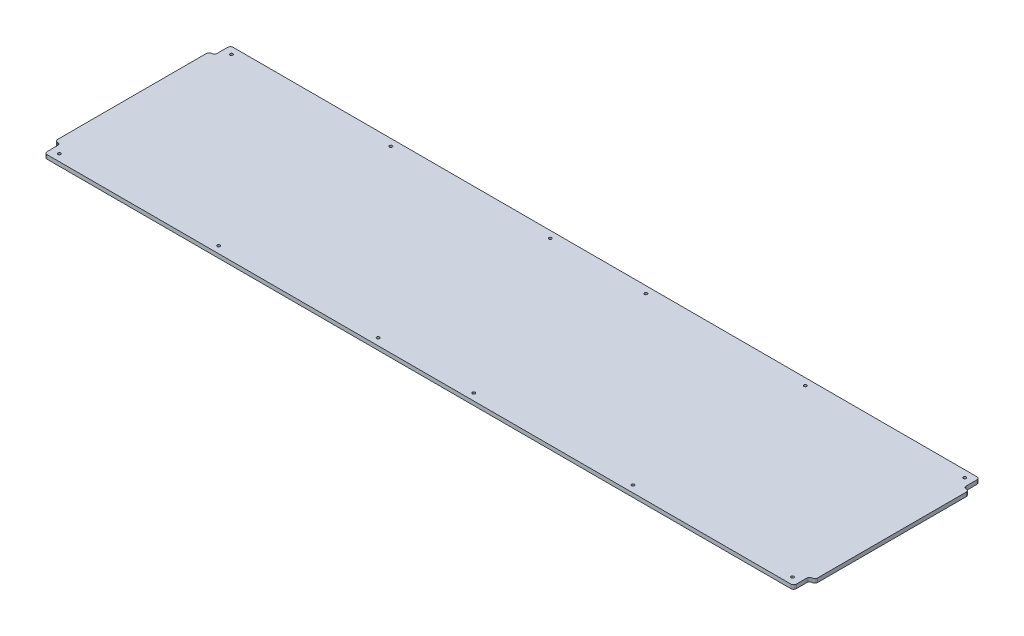
ISO-10303-21;
HEADER;
FILE_DESCRIPTION(('STEP AP214'),'2;1');
FILE_NAME('part.step','',(''),(''),'','','');
FILE_SCHEMA(('AUTOMOTIVE_DESIGN { 1 0 10303 214 1 1 1 1 }'));
ENDSEC;
DATA;
#1=APPLICATION_CONTEXT('core data for automotive mechanical design processes');
#2=APPLICATION_PROTOCOL_DEFINITION('international standard','automotive_design',2000,#1);
#3=PRODUCT_CONTEXT('',#1,'mechanical');
#4=PRODUCT('Part','Part','',(#3));
#5=PRODUCT_RELATED_PRODUCT_CATEGORY('part','',(#4));
#6=PRODUCT_DEFINITION_FORMATION('','',#4);
#7=PRODUCT_DEFINITION_CONTEXT('part definition',#1,'design');
#8=PRODUCT_DEFINITION('design','',#6,#7);
#9=PRODUCT_DEFINITION_SHAPE('','',#8);
#10=(LENGTH_UNIT() NAMED_UNIT(*) SI_UNIT(.MILLI.,.METRE.));
#11=(NAMED_UNIT(*) PLANE_ANGLE_UNIT() SI_UNIT($,.RADIAN.));
#12=(NAMED_UNIT(*) SI_UNIT($,.STERADIAN.) SOLID_ANGLE_UNIT());
#13=UNCERTAINTY_MEASURE_WITH_UNIT(LENGTH_MEASURE(1.E-05),#10,'distance_accuracy_value','');
#14=(GEOMETRIC_REPRESENTATION_CONTEXT(3) GLOBAL_UNCERTAINTY_ASSIGNED_CONTEXT((#13)) GLOBAL_UNIT_ASSIGNED_CONTEXT((#10,
#11,#12)) REPRESENTATION_CONTEXT('',''));
#15=CARTESIAN_POINT('',(0.,0.,0.));
#16=DIRECTION('',(0.,0.,1.));
#17=DIRECTION('',(1.,0.,0.));
#18=AXIS2_PLACEMENT_3D('',#15,#16,#17);
#19=CARTESIAN_POINT('',(895.35,9.525,222.25));
#20=DIRECTION('',(-1.,0.,0.));
#21=DIRECTION('',(0.,0.,1.));
#22=AXIS2_PLACEMENT_3D('',#19,#20,#21);
#23=PLANE('',#22);
#24=DIRECTION('',(0.,0.,-1.));
#25=VECTOR('',#24,1.);
#26=CARTESIAN_POINT('',(895.35,9.525,222.25));
#27=LINE('',#26,#25);
#28=CARTESIAN_POINT('',(895.35,9.525,215.9));
#29=VERTEX_POINT('',#28);
#30=CARTESIAN_POINT('',(895.35,9.525,190.5));
#31=VERTEX_POINT('',#30);
#32=EDGE_CURVE('E198',#29,#31,#27,.T.);
#33=ORIENTED_EDGE('',*,*,#32,.F.);
#34=DIRECTION('',(0.,-1.,0.));
#35=VECTOR('',#34,1.);
#36=CARTESIAN_POINT('',(895.35,9.525,215.9));
#37=LINE('',#36,#35);
#38=CARTESIAN_POINT('',(895.35,0.,215.9));
#39=VERTEX_POINT('',#38);
#40=EDGE_CURVE('E181',#29,#39,#37,.T.);
#41=ORIENTED_EDGE('',*,*,#40,.T.);
#42=DIRECTION('',(0.,0.,-1.));
#43=VECTOR('',#42,1.);
#44=CARTESIAN_POINT('',(895.35,0.,222.25));
#45=LINE('',#44,#43);
#46=CARTESIAN_POINT('',(895.35,0.,190.5));
#47=VERTEX_POINT('',#46);
#48=EDGE_CURVE('E195',#39,#47,#45,.T.);
#49=ORIENTED_EDGE('',*,*,#48,.T.);
#50=DIRECTION('',(0.,-1.,0.));
#51=VECTOR('',#50,1.);
#52=CARTESIAN_POINT('',(895.35,9.525,190.5));
#53=LINE('',#52,#51);
#54=EDGE_CURVE('E201',#47,#31,#53,.F.);
#55=ORIENTED_EDGE('',*,*,#54,.T.);
#56=EDGE_LOOP('',(#33,#41,#49,#55));
#57=FACE_BOUND('',#56,.T.);
#58=ADVANCED_FACE('F38',(#57),#23,.F.);
#59=CARTESIAN_POINT('',(908.05,9.525,-184.15));
#60=DIRECTION('',(-1.,0.,0.));
#61=DIRECTION('',(0.,0.,1.));
#62=AXIS2_PLACEMENT_3D('',#59,#60,#61);
#63=PLANE('',#62);
#64=DIRECTION('',(0.,0.,-1.));
#65=VECTOR('',#64,1.);
#66=CARTESIAN_POINT('',(908.05,9.525,-184.15));
#67=LINE('',#66,#65);
#68=CARTESIAN_POINT('',(908.05,9.525,177.8));
#69=VERTEX_POINT('',#68);
#70=CARTESIAN_POINT('',(908.05,9.525,-177.8));
#71=VERTEX_POINT('',#70);
#72=EDGE_CURVE('E816',#69,#71,#67,.T.);
#73=ORIENTED_EDGE('',*,*,#72,.F.);
#74=DIRECTION('',(0.,-1.,0.));
#75=VECTOR('',#74,1.);
#76=CARTESIAN_POINT('',(908.05,9.525,177.8));
#77=LINE('',#76,#75);
#78=CARTESIAN_POINT('',(908.05,0.,177.8));
#79=VERTEX_POINT('',#78);
#80=EDGE_CURVE('E298',#69,#79,#77,.T.);
#81=ORIENTED_EDGE('',*,*,#80,.T.);
#82=DIRECTION('',(0.,0.,-1.));
#83=VECTOR('',#82,1.);
#84=CARTESIAN_POINT('',(908.05,0.,-184.15));
#85=LINE('',#84,#83);
#86=CARTESIAN_POINT('',(908.05,0.,-177.8));
#87=VERTEX_POINT('',#86);
#88=EDGE_CURVE('E207',#79,#87,#85,.T.);
#89=ORIENTED_EDGE('',*,*,#88,.T.);
#90=DIRECTION('',(0.,-1.,0.));
#91=VECTOR('',#90,1.);
#92=CARTESIAN_POINT('',(908.05,9.525,-177.8));
#93=LINE('',#92,#91);
#94=EDGE_CURVE('E294',#87,#71,#93,.F.);
#95=ORIENTED_EDGE('',*,*,#94,.T.);
#96=EDGE_LOOP('',(#73,#81,#89,#95));
#97=FACE_BOUND('',#96,.T.);
#98=ADVANCED_FACE('F436',(#97),#63,.F.);
#99=CARTESIAN_POINT('',(895.35,9.525,-222.25));
#100=DIRECTION('',(-1.,0.,0.));
#101=DIRECTION('',(0.,0.,1.));
#102=AXIS2_PLACEMENT_3D('',#99,#100,#101);
#103=PLANE('',#102);
#104=DIRECTION('',(0.,0.,-1.));
#105=VECTOR('',#104,1.);
#106=CARTESIAN_POINT('',(895.35,9.525,-222.25));
#107=LINE('',#106,#105);
#108=CARTESIAN_POINT('',(895.35,9.525,-190.5));
#109=VERTEX_POINT('',#108);
#110=CARTESIAN_POINT('',(895.35,9.525,-215.9));
#111=VERTEX_POINT('',#110);
#112=EDGE_CURVE('E412',#109,#111,#107,.T.);
#113=ORIENTED_EDGE('',*,*,#112,.F.);
#114=DIRECTION('',(0.,-1.,0.));
#115=VECTOR('',#114,1.);
#116=CARTESIAN_POINT('',(895.35,0.,-190.5));
#117=LINE('',#116,#115);
#118=CARTESIAN_POINT('',(895.35,0.,-190.5));
#119=VERTEX_POINT('',#118);
#120=EDGE_CURVE('E304',#109,#119,#117,.T.);
#121=ORIENTED_EDGE('',*,*,#120,.T.);
#122=DIRECTION('',(0.,0.,-1.));
#123=VECTOR('',#122,1.);
#124=CARTESIAN_POINT('',(895.35,0.,-222.25));
#125=LINE('',#124,#123);
#126=CARTESIAN_POINT('',(895.35,0.,-215.9));
#127=VERTEX_POINT('',#126);
#128=EDGE_CURVE('E214',#119,#127,#125,.T.);
#129=ORIENTED_EDGE('',*,*,#128,.T.);
#130=DIRECTION('',(0.,-1.,0.));
#131=VECTOR('',#130,1.);
#132=CARTESIAN_POINT('',(895.35,9.525,-215.9));
#133=LINE('',#132,#131);
#134=EDGE_CURVE('E301',#127,#111,#133,.F.);
#135=ORIENTED_EDGE('',*,*,#134,.T.);
#136=EDGE_LOOP('',(#113,#121,#129,#135));
#137=FACE_BOUND('',#136,.T.);
#138=ADVANCED_FACE('F441',(#137),#103,.F.);
#139=CARTESIAN_POINT('',(-895.35,9.525,-222.25));
#140=DIRECTION('',(0.,0.,1.));
#141=DIRECTION('',(1.,0.,0.));
#142=AXIS2_PLACEMENT_3D('',#139,#140,#141);
#143=PLANE('',#142);
#144=DIRECTION('',(-1.,0.,0.));
#145=VECTOR('',#144,1.);
#146=CARTESIAN_POINT('',(-895.35,9.525,-222.25));
#147=LINE('',#146,#145);
#148=CARTESIAN_POINT('',(889.,9.525,-222.25));
#149=VERTEX_POINT('',#148);
#150=CARTESIAN_POINT('',(-889.,9.525,-222.25));
#151=VERTEX_POINT('',#150);
#152=EDGE_CURVE('E405',#149,#151,#147,.T.);
#153=ORIENTED_EDGE('',*,*,#152,.F.);
#154=DIRECTION('',(0.,-1.,0.));
#155=VECTOR('',#154,1.);
#156=CARTESIAN_POINT('',(889.,9.525,-222.25));
#157=LINE('',#156,#155);
#158=CARTESIAN_POINT('',(889.,0.,-222.25));
#159=VERTEX_POINT('',#158);
#160=EDGE_CURVE('E310',#149,#159,#157,.T.);
#161=ORIENTED_EDGE('',*,*,#160,.T.);
#162=DIRECTION('',(-1.,0.,0.));
#163=VECTOR('',#162,1.);
#164=CARTESIAN_POINT('',(-895.35,0.,-222.25));
#165=LINE('',#164,#163);
#166=CARTESIAN_POINT('',(-889.,0.,-222.25));
#167=VERTEX_POINT('',#166);
#168=EDGE_CURVE('E226',#159,#167,#165,.T.);
#169=ORIENTED_EDGE('',*,*,#168,.T.);
#170=DIRECTION('',(0.,-1.,0.));
#171=VECTOR('',#170,1.);
#172=CARTESIAN_POINT('',(-889.,9.525,-222.25));
#173=LINE('',#172,#171);
#174=EDGE_CURVE('E307',#167,#151,#173,.F.);
#175=ORIENTED_EDGE('',*,*,#174,.T.);
#176=EDGE_LOOP('',(#153,#161,#169,#175));
#177=FACE_BOUND('',#176,.T.);
#178=ADVANCED_FACE('F656',(#177),#143,.F.);
#179=CARTESIAN_POINT('',(-895.35,9.525,-222.25));
#180=DIRECTION('',(1.,0.,0.));
#181=DIRECTION('',(0.,0.,-1.));
#182=AXIS2_PLACEMENT_3D('',#179,#180,#181);
#183=PLANE('',#182);
#184=DIRECTION('',(0.,0.,1.));
#185=VECTOR('',#184,1.);
#186=CARTESIAN_POINT('',(-895.35,0.,-222.25));
#187=LINE('',#186,#185);
#188=CARTESIAN_POINT('',(-895.35,0.,-215.9));
#189=VERTEX_POINT('',#188);
#190=CARTESIAN_POINT('',(-895.35,0.,-190.5));
#191=VERTEX_POINT('',#190);
#192=EDGE_CURVE('E230',#189,#191,#187,.T.);
#193=ORIENTED_EDGE('',*,*,#192,.T.);
#194=DIRECTION('',(0.,-1.,0.));
#195=VECTOR('',#194,1.);
#196=CARTESIAN_POINT('',(-895.35,9.525,-190.5));
#197=LINE('',#196,#195);
#198=CARTESIAN_POINT('',(-895.35,9.525,-190.5));
#199=VERTEX_POINT('',#198);
#200=EDGE_CURVE('E325',#191,#199,#197,.F.);
#201=ORIENTED_EDGE('',*,*,#200,.T.);
#202=DIRECTION('',(0.,0.,1.));
#203=VECTOR('',#202,1.);
#204=CARTESIAN_POINT('',(-895.35,9.525,-222.25));
#205=LINE('',#204,#203);
#206=CARTESIAN_POINT('',(-895.35,9.525,-215.9));
#207=VERTEX_POINT('',#206);
#208=EDGE_CURVE('E398',#207,#199,#205,.T.);
#209=ORIENTED_EDGE('',*,*,#208,.F.);
#210=DIRECTION('',(0.,-1.,0.));
#211=VECTOR('',#210,1.);
#212=CARTESIAN_POINT('',(-895.35,9.525,-215.9));
#213=LINE('',#212,#211);
#214=EDGE_CURVE('E321',#207,#189,#213,.T.);
#215=ORIENTED_EDGE('',*,*,#214,.T.);
#216=EDGE_LOOP('',(#193,#201,#209,#215));
#217=FACE_BOUND('',#216,.T.);
#218=ADVANCED_FACE('F397',(#217),#183,.F.);
#219=CARTESIAN_POINT('',(-908.05,9.525,-184.15));
#220=DIRECTION('',(1.,0.,0.));
#221=DIRECTION('',(0.,0.,-1.));
#222=AXIS2_PLACEMENT_3D('',#219,#220,#221);
#223=PLANE('',#222);
#224=DIRECTION('',(0.,0.,1.));
#225=VECTOR('',#224,1.);
#226=CARTESIAN_POINT('',(-908.05,9.525,-184.15));
#227=LINE('',#226,#225);
#228=CARTESIAN_POINT('',(-908.05,9.525,-177.8));
#229=VERTEX_POINT('',#228);
#230=CARTESIAN_POINT('',(-908.05,9.525,177.8));
#231=VERTEX_POINT('',#230);
#232=EDGE_CURVE('E386',#229,#231,#227,.T.);
#233=ORIENTED_EDGE('',*,*,#232,.F.);
#234=DIRECTION('',(0.,-1.,0.));
#235=VECTOR('',#234,1.);
#236=CARTESIAN_POINT('',(-908.05,9.525,-177.8));
#237=LINE('',#236,#235);
#238=CARTESIAN_POINT('',(-908.05,0.,-177.8));
#239=VERTEX_POINT('',#238);
#240=EDGE_CURVE('E317',#229,#239,#237,.T.);
#241=ORIENTED_EDGE('',*,*,#240,.T.);
#242=DIRECTION('',(0.,0.,1.));
#243=VECTOR('',#242,1.);
#244=CARTESIAN_POINT('',(-908.05,0.,-184.15));
#245=LINE('',#244,#243);
#246=CARTESIAN_POINT('',(-908.05,0.,177.8));
#247=VERTEX_POINT('',#246);
#248=EDGE_CURVE('E234',#239,#247,#245,.T.);
#249=ORIENTED_EDGE('',*,*,#248,.T.);
#250=DIRECTION('',(0.,-1.,0.));
#251=VECTOR('',#250,1.);
#252=CARTESIAN_POINT('',(-908.05,9.525,177.8));
#253=LINE('',#252,#251);
#254=EDGE_CURVE('E314',#247,#231,#253,.F.);
#255=ORIENTED_EDGE('',*,*,#254,.T.);
#256=EDGE_LOOP('',(#233,#241,#249,#255));
#257=FACE_BOUND('',#256,.T.);
#258=ADVANCED_FACE('F383',(#257),#223,.F.);
#259=CARTESIAN_POINT('',(-895.35,9.525,184.15));
#260=DIRECTION('',(1.,0.,0.));
#261=DIRECTION('',(0.,0.,-1.));
#262=AXIS2_PLACEMENT_3D('',#259,#260,#261);
#263=PLANE('',#262);
#264=DIRECTION('',(0.,0.,1.));
#265=VECTOR('',#264,1.);
#266=CARTESIAN_POINT('',(-895.35,0.,184.15));
#267=LINE('',#266,#265);
#268=CARTESIAN_POINT('',(-895.35,0.,190.5));
#269=VERTEX_POINT('',#268);
#270=CARTESIAN_POINT('',(-895.35,0.,215.9));
#271=VERTEX_POINT('',#270);
#272=EDGE_CURVE('E238',#269,#271,#267,.T.);
#273=ORIENTED_EDGE('',*,*,#272,.T.);
#274=DIRECTION('',(0.,-1.,0.));
#275=VECTOR('',#274,1.);
#276=CARTESIAN_POINT('',(-895.35,9.525,215.9));
#277=LINE('',#276,#275);
#278=CARTESIAN_POINT('',(-895.35,9.525,215.9));
#279=VERTEX_POINT('',#278);
#280=EDGE_CURVE('E56',#271,#279,#277,.F.);
#281=ORIENTED_EDGE('',*,*,#280,.T.);
#282=DIRECTION('',(0.,0.,1.));
#283=VECTOR('',#282,1.);
#284=CARTESIAN_POINT('',(-895.35,9.525,184.15));
#285=LINE('',#284,#283);
#286=CARTESIAN_POINT('',(-895.35,9.525,190.5));
#287=VERTEX_POINT('',#286);
#288=EDGE_CURVE('E410',#287,#279,#285,.T.);
#289=ORIENTED_EDGE('',*,*,#288,.F.);
#290=DIRECTION('',(0.,-1.,0.));
#291=VECTOR('',#290,1.);
#292=CARTESIAN_POINT('',(-895.35,0.,190.5));
#293=LINE('',#292,#291);
#294=EDGE_CURVE('E328',#287,#269,#293,.T.);
#295=ORIENTED_EDGE('',*,*,#294,.T.);
#296=EDGE_LOOP('',(#273,#281,#289,#295));
#297=FACE_BOUND('',#296,.T.);
#298=ADVANCED_FACE('F426',(#297),#263,.F.);
#299=CARTESIAN_POINT('',(-895.35,9.525,222.25));
#300=DIRECTION('',(0.,0.,-1.));
#301=DIRECTION('',(-1.,0.,0.));
#302=AXIS2_PLACEMENT_3D('',#299,#300,#301);
#303=PLANE('',#302);
#304=DIRECTION('',(1.,0.,0.));
#305=VECTOR('',#304,1.);
#306=CARTESIAN_POINT('',(-895.35,0.,222.25));
#307=LINE('',#306,#305);
#308=CARTESIAN_POINT('',(-889.,0.,222.25));
#309=VERTEX_POINT('',#308);
#310=CARTESIAN_POINT('',(889.,0.,222.25));
#311=VERTEX_POINT('',#310);
#312=EDGE_CURVE('E241',#309,#311,#307,.T.);
#313=ORIENTED_EDGE('',*,*,#312,.T.);
#314=DIRECTION('',(0.,-1.,0.));
#315=VECTOR('',#314,1.);
#316=CARTESIAN_POINT('',(889.,9.525,222.25));
#317=LINE('',#316,#315);
#318=CARTESIAN_POINT('',(889.,9.525,222.25));
#319=VERTEX_POINT('',#318);
#320=EDGE_CURVE('E182',#311,#319,#317,.F.);
#321=ORIENTED_EDGE('',*,*,#320,.T.);
#322=DIRECTION('',(1.,0.,0.));
#323=VECTOR('',#322,1.);
#324=CARTESIAN_POINT('',(-895.35,9.525,222.25));
#325=LINE('',#324,#323);
#326=CARTESIAN_POINT('',(-889.,9.525,222.25));
#327=VERTEX_POINT('',#326);
#328=EDGE_CURVE('E220',#327,#319,#325,.T.);
#329=ORIENTED_EDGE('',*,*,#328,.F.);
#330=DIRECTION('',(0.,-1.,0.));
#331=VECTOR('',#330,1.);
#332=CARTESIAN_POINT('',(-889.,9.525,222.25));
#333=LINE('',#332,#331);
#334=EDGE_CURVE('E188',#327,#309,#333,.T.);
#335=ORIENTED_EDGE('',*,*,#334,.T.);
#336=EDGE_LOOP('',(#313,#321,#329,#335));
#337=FACE_BOUND('',#336,.T.);
#338=ADVANCED_FACE('F423',(#337),#303,.F.);
#339=CARTESIAN_POINT('',(0.,9.525,0.));
#340=DIRECTION('',(0.,1.,0.));
#341=DIRECTION('',(0.,0.,1.));
#342=AXIS2_PLACEMENT_3D('',#339,#340,#341);
#343=PLANE('',#342);
#344=CARTESIAN_POINT('',(-876.3,9.525,205.74));
#345=DIRECTION('',(0.,1.,0.));
#346=DIRECTION('',(0.,0.,1.));
#347=AXIS2_PLACEMENT_3D('',#344,#345,#346);
#348=CIRCLE('',#347,3.373501);
#349=CARTESIAN_POINT('',(-876.3,9.525,209.113501));
#350=VERTEX_POINT('',#349);
#351=EDGE_CURVE('E357',#350,#350,#348,.T.);
#352=ORIENTED_EDGE('',*,*,#351,.F.);
#353=EDGE_LOOP('',(#352));
#354=FACE_BOUND('',#353,.T.);
#355=CARTESIAN_POINT('',(-495.3,9.525,205.74));
#356=DIRECTION('',(0.,1.,0.));
#357=DIRECTION('',(0.,0.,1.));
#358=AXIS2_PLACEMENT_3D('',#355,#356,#357);
#359=CIRCLE('',#358,3.373501);
#360=CARTESIAN_POINT('',(-495.3,9.525,209.113501));
#361=VERTEX_POINT('',#360);
#362=EDGE_CURVE('E917',#361,#361,#359,.T.);
#363=ORIENTED_EDGE('',*,*,#362,.F.);
#364=EDGE_LOOP('',(#363));
#365=FACE_BOUND('',#364,.T.);
#366=CARTESIAN_POINT('',(-876.3,9.525,-205.74));
#367=DIRECTION('',(0.,1.,0.));
#368=DIRECTION('',(0.,0.,1.));
#369=AXIS2_PLACEMENT_3D('',#366,#367,#368);
#370=CIRCLE('',#369,3.373501);
#371=CARTESIAN_POINT('',(-876.3,9.525,-202.366499));
#372=VERTEX_POINT('',#371);
#373=EDGE_CURVE('E909',#372,#372,#370,.T.);
#374=ORIENTED_EDGE('',*,*,#373,.F.);
#375=EDGE_LOOP('',(#374));
#376=FACE_BOUND('',#375,.T.);
#377=CARTESIAN_POINT('',(-495.3,9.525,-205.74));
#378=DIRECTION('',(0.,1.,0.));
#379=DIRECTION('',(0.,0.,1.));
#380=AXIS2_PLACEMENT_3D('',#377,#378,#379);
#381=CIRCLE('',#380,3.373501);
#382=CARTESIAN_POINT('',(-495.3,9.525,-202.366499));
#383=VERTEX_POINT('',#382);
#384=EDGE_CURVE('E901',#383,#383,#381,.T.);
#385=ORIENTED_EDGE('',*,*,#384,.F.);
#386=EDGE_LOOP('',(#385));
#387=FACE_BOUND('',#386,.T.);
#388=CARTESIAN_POINT('',(-114.3,9.525,-205.74));
#389=DIRECTION('',(0.,1.,0.));
#390=DIRECTION('',(0.,0.,1.));
#391=AXIS2_PLACEMENT_3D('',#388,#389,#390);
#392=CIRCLE('',#391,3.373501);
#393=CARTESIAN_POINT('',(-114.3,9.525,-202.366499));
#394=VERTEX_POINT('',#393);
#395=EDGE_CURVE('E893',#394,#394,#392,.T.);
#396=ORIENTED_EDGE('',*,*,#395,.F.);
#397=EDGE_LOOP('',(#396));
#398=FACE_BOUND('',#397,.T.);
#399=CARTESIAN_POINT('',(-114.3,9.525,205.74));
#400=DIRECTION('',(0.,1.,0.));
#401=DIRECTION('',(0.,0.,1.));
#402=AXIS2_PLACEMENT_3D('',#399,#400,#401);
#403=CIRCLE('',#402,3.373501);
#404=CARTESIAN_POINT('',(-114.3,9.525,209.113501));
#405=VERTEX_POINT('',#404);
#406=EDGE_CURVE('E885',#405,#405,#403,.T.);
#407=ORIENTED_EDGE('',*,*,#406,.F.);
#408=EDGE_LOOP('',(#407));
#409=FACE_BOUND('',#408,.T.);
#410=CARTESIAN_POINT('',(114.299999999999,9.525,205.74));
#411=DIRECTION('',(0.,1.,0.));
#412=DIRECTION('',(0.,0.,1.));
#413=AXIS2_PLACEMENT_3D('',#410,#411,#412);
#414=CIRCLE('',#413,3.373501);
#415=CARTESIAN_POINT('',(114.299999999999,9.525,209.113501));
#416=VERTEX_POINT('',#415);
#417=EDGE_CURVE('E877',#416,#416,#414,.T.);
#418=ORIENTED_EDGE('',*,*,#417,.F.);
#419=EDGE_LOOP('',(#418));
#420=FACE_BOUND('',#419,.T.);
#421=CARTESIAN_POINT('',(114.3,9.525,-205.74));
#422=DIRECTION('',(0.,1.,0.));
#423=DIRECTION('',(0.,0.,1.));
#424=AXIS2_PLACEMENT_3D('',#421,#422,#423);
#425=CIRCLE('',#424,3.373501);
#426=CARTESIAN_POINT('',(114.3,9.525,-202.366499));
#427=VERTEX_POINT('',#426);
#428=EDGE_CURVE('E869',#427,#427,#425,.T.);
#429=ORIENTED_EDGE('',*,*,#428,.F.);
#430=EDGE_LOOP('',(#429));
#431=FACE_BOUND('',#430,.T.);
#432=CARTESIAN_POINT('',(495.3,9.525,-205.739999999999));
#433=DIRECTION('',(0.,1.,0.));
#434=DIRECTION('',(0.,0.,1.));
#435=AXIS2_PLACEMENT_3D('',#432,#433,#434);
#436=CIRCLE('',#435,3.373501);
#437=CARTESIAN_POINT('',(495.3,9.525,-202.366498999999));
#438=VERTEX_POINT('',#437);
#439=EDGE_CURVE('E861',#438,#438,#436,.T.);
#440=ORIENTED_EDGE('',*,*,#439,.F.);
#441=EDGE_LOOP('',(#440));
#442=FACE_BOUND('',#441,.T.);
#443=CARTESIAN_POINT('',(876.3,9.525,-205.739999999999));
#444=DIRECTION('',(0.,1.,0.));
#445=DIRECTION('',(0.,0.,1.));
#446=AXIS2_PLACEMENT_3D('',#443,#444,#445);
#447=CIRCLE('',#446,3.373501);
#448=CARTESIAN_POINT('',(876.3,9.525,-202.366498999999));
#449=VERTEX_POINT('',#448);
#450=EDGE_CURVE('E853',#449,#449,#447,.T.);
#451=ORIENTED_EDGE('',*,*,#450,.F.);
#452=EDGE_LOOP('',(#451));
#453=FACE_BOUND('',#452,.T.);
#454=CARTESIAN_POINT('',(495.299999999999,9.525,205.74));
#455=DIRECTION('',(0.,1.,0.));
#456=DIRECTION('',(0.,0.,1.));
#457=AXIS2_PLACEMENT_3D('',#454,#455,#456);
#458=CIRCLE('',#457,3.373501);
#459=CARTESIAN_POINT('',(495.299999999999,9.525,209.113501));
#460=VERTEX_POINT('',#459);
#461=EDGE_CURVE('E845',#460,#460,#458,.T.);
#462=ORIENTED_EDGE('',*,*,#461,.F.);
#463=EDGE_LOOP('',(#462));
#464=FACE_BOUND('',#463,.T.);
#465=CARTESIAN_POINT('',(876.299999999999,9.525,205.740000000001));
#466=DIRECTION('',(0.,1.,0.));
#467=DIRECTION('',(0.,0.,1.));
#468=AXIS2_PLACEMENT_3D('',#465,#466,#467);
#469=CIRCLE('',#468,3.373501);
#470=CARTESIAN_POINT('',(876.299999999999,9.525,209.113501000001));
#471=VERTEX_POINT('',#470);
#472=EDGE_CURVE('E217',#471,#471,#469,.T.);
#473=ORIENTED_EDGE('',*,*,#472,.F.);
#474=EDGE_LOOP('',(#473));
#475=FACE_BOUND('',#474,.T.);
#476=ORIENTED_EDGE('',*,*,#328,.T.);
#477=CARTESIAN_POINT('',(889.,9.525,215.9));
#478=DIRECTION('',(0.,1.,0.));
#479=DIRECTION('',(0.,0.,1.));
#480=AXIS2_PLACEMENT_3D('',#477,#478,#479);
#481=CIRCLE('',#480,6.35);
#482=EDGE_CURVE('E291',#319,#29,#481,.T.);
#483=ORIENTED_EDGE('',*,*,#482,.T.);
#484=ORIENTED_EDGE('',*,*,#32,.T.);
#485=CARTESIAN_POINT('',(901.7,9.525,190.5));
#486=DIRECTION('',(0.,1.,0.));
#487=DIRECTION('',(0.,0.,1.));
#488=AXIS2_PLACEMENT_3D('',#485,#486,#487);
#489=CIRCLE('',#488,6.35);
#490=CARTESIAN_POINT('',(901.7,9.525,184.15));
#491=VERTEX_POINT('',#490);
#492=EDGE_CURVE('E336',#31,#491,#489,.F.);
#493=ORIENTED_EDGE('',*,*,#492,.T.);
#494=CARTESIAN_POINT('',(901.7,9.525,177.8));
#495=DIRECTION('',(0.,1.,0.));
#496=DIRECTION('',(0.,0.,1.));
#497=AXIS2_PLACEMENT_3D('',#494,#495,#496);
#498=CIRCLE('',#497,6.35);
#499=EDGE_CURVE('E288',#491,#69,#498,.T.);
#500=ORIENTED_EDGE('',*,*,#499,.T.);
#501=ORIENTED_EDGE('',*,*,#72,.T.);
#502=CARTESIAN_POINT('',(901.7,9.525,-177.8));
#503=DIRECTION('',(0.,1.,0.));
#504=DIRECTION('',(0.,0.,1.));
#505=AXIS2_PLACEMENT_3D('',#502,#503,#504);
#506=CIRCLE('',#505,6.35);
#507=CARTESIAN_POINT('',(901.7,9.525,-184.15));
#508=VERTEX_POINT('',#507);
#509=EDGE_CURVE('E285',#71,#508,#506,.T.);
#510=ORIENTED_EDGE('',*,*,#509,.T.);
#511=CARTESIAN_POINT('',(901.7,9.525,-190.5));
#512=DIRECTION('',(0.,1.,0.));
#513=DIRECTION('',(0.,0.,1.));
#514=AXIS2_PLACEMENT_3D('',#511,#512,#513);
#515=CIRCLE('',#514,6.35);
#516=EDGE_CURVE('E342',#508,#109,#515,.F.);
#517=ORIENTED_EDGE('',*,*,#516,.T.);
#518=ORIENTED_EDGE('',*,*,#112,.T.);
#519=CARTESIAN_POINT('',(889.,9.525,-215.9));
#520=DIRECTION('',(0.,1.,0.));
#521=DIRECTION('',(0.,0.,1.));
#522=AXIS2_PLACEMENT_3D('',#519,#520,#521);
#523=CIRCLE('',#522,6.35);
#524=EDGE_CURVE('E282',#111,#149,#523,.T.);
#525=ORIENTED_EDGE('',*,*,#524,.T.);
#526=ORIENTED_EDGE('',*,*,#152,.T.);
#527=CARTESIAN_POINT('',(-889.,9.525,-215.9));
#528=DIRECTION('',(0.,1.,0.));
#529=DIRECTION('',(0.,0.,1.));
#530=AXIS2_PLACEMENT_3D('',#527,#528,#529);
#531=CIRCLE('',#530,6.35);
#532=EDGE_CURVE('E276',#151,#207,#531,.T.);
#533=ORIENTED_EDGE('',*,*,#532,.T.);
#534=ORIENTED_EDGE('',*,*,#208,.T.);
#535=CARTESIAN_POINT('',(-901.7,9.525,-190.5));
#536=DIRECTION('',(0.,1.,0.));
#537=DIRECTION('',(0.,0.,1.));
#538=AXIS2_PLACEMENT_3D('',#535,#536,#537);
#539=CIRCLE('',#538,6.35);
#540=CARTESIAN_POINT('',(-901.7,9.525,-184.15));
#541=VERTEX_POINT('',#540);
#542=EDGE_CURVE('E348',#199,#541,#539,.F.);
#543=ORIENTED_EDGE('',*,*,#542,.T.);
#544=CARTESIAN_POINT('',(-901.7,9.525,-177.8));
#545=DIRECTION('',(0.,1.,0.));
#546=DIRECTION('',(0.,0.,1.));
#547=AXIS2_PLACEMENT_3D('',#544,#545,#546);
#548=CIRCLE('',#547,6.35);
#549=EDGE_CURVE('E279',#541,#229,#548,.T.);
#550=ORIENTED_EDGE('',*,*,#549,.T.);
#551=ORIENTED_EDGE('',*,*,#232,.T.);
#552=CARTESIAN_POINT('',(-901.7,9.525,177.8));
#553=DIRECTION('',(0.,1.,0.));
#554=DIRECTION('',(0.,0.,1.));
#555=AXIS2_PLACEMENT_3D('',#552,#553,#554);
#556=CIRCLE('',#555,6.35);
#557=CARTESIAN_POINT('',(-901.7,9.525,184.15));
#558=VERTEX_POINT('',#557);
#559=EDGE_CURVE('E270',#231,#558,#556,.T.);
#560=ORIENTED_EDGE('',*,*,#559,.T.);
#561=CARTESIAN_POINT('',(-901.7,9.525,190.5));
#562=DIRECTION('',(0.,1.,0.));
#563=DIRECTION('',(0.,0.,1.));
#564=AXIS2_PLACEMENT_3D('',#561,#562,#563);
#565=CIRCLE('',#564,6.35);
#566=EDGE_CURVE('E11',#558,#287,#565,.F.);
#567=ORIENTED_EDGE('',*,*,#566,.T.);
#568=ORIENTED_EDGE('',*,*,#288,.T.);
#569=CARTESIAN_POINT('',(-889.,9.525,215.9));
#570=DIRECTION('',(0.,1.,0.));
#571=DIRECTION('',(0.,0.,1.));
#572=AXIS2_PLACEMENT_3D('',#569,#570,#571);
#573=CIRCLE('',#572,6.35);
#574=EDGE_CURVE('E273',#279,#327,#573,.T.);
#575=ORIENTED_EDGE('',*,*,#574,.T.);
#576=EDGE_LOOP('',(#476,#483,#484,#493,#500,#501,#510,#517,#518,#525,#526,#533,#534,#543,#550,
#551,#560,#567,#568,#575));
#577=FACE_BOUND('',#576,.T.);
#578=ADVANCED_FACE('F401',(#354,#365,#376,#387,#398,#409,#420,#431,#442,#453,#464,#475,#577),
#343,.T.);
#579=CARTESIAN_POINT('',(0.,0.,0.));
#580=DIRECTION('',(0.,1.,0.));
#581=DIRECTION('',(0.,0.,1.));
#582=AXIS2_PLACEMENT_3D('',#579,#580,#581);
#583=PLANE('',#582);
#584=CARTESIAN_POINT('',(-876.3,0.,205.74));
#585=DIRECTION('',(0.,1.,0.));
#586=DIRECTION('',(0.,0.,1.));
#587=AXIS2_PLACEMENT_3D('',#584,#585,#586);
#588=CIRCLE('',#587,3.373501);
#589=CARTESIAN_POINT('',(-876.3,0.,209.113501));
#590=VERTEX_POINT('',#589);
#591=EDGE_CURVE('E921',#590,#590,#588,.T.);
#592=ORIENTED_EDGE('',*,*,#591,.T.);
#593=EDGE_LOOP('',(#592));
#594=FACE_BOUND('',#593,.T.);
#595=CARTESIAN_POINT('',(-495.3,0.,205.74));
#596=DIRECTION('',(0.,1.,0.));
#597=DIRECTION('',(0.,0.,1.));
#598=AXIS2_PLACEMENT_3D('',#595,#596,#597);
#599=CIRCLE('',#598,3.373501);
#600=CARTESIAN_POINT('',(-495.3,0.,209.113501));
#601=VERTEX_POINT('',#600);
#602=EDGE_CURVE('E913',#601,#601,#599,.T.);
#603=ORIENTED_EDGE('',*,*,#602,.T.);
#604=EDGE_LOOP('',(#603));
#605=FACE_BOUND('',#604,.T.);
#606=CARTESIAN_POINT('',(-876.3,0.,-205.74));
#607=DIRECTION('',(0.,1.,0.));
#608=DIRECTION('',(0.,0.,1.));
#609=AXIS2_PLACEMENT_3D('',#606,#607,#608);
#610=CIRCLE('',#609,3.373501);
#611=CARTESIAN_POINT('',(-876.3,0.,-202.366499));
#612=VERTEX_POINT('',#611);
#613=EDGE_CURVE('E905',#612,#612,#610,.T.);
#614=ORIENTED_EDGE('',*,*,#613,.T.);
#615=EDGE_LOOP('',(#614));
#616=FACE_BOUND('',#615,.T.);
#617=CARTESIAN_POINT('',(-495.3,0.,-205.74));
#618=DIRECTION('',(0.,1.,0.));
#619=DIRECTION('',(0.,0.,1.));
#620=AXIS2_PLACEMENT_3D('',#617,#618,#619);
#621=CIRCLE('',#620,3.373501);
#622=CARTESIAN_POINT('',(-495.3,0.,-202.366499));
#623=VERTEX_POINT('',#622);
#624=EDGE_CURVE('E897',#623,#623,#621,.T.);
#625=ORIENTED_EDGE('',*,*,#624,.T.);
#626=EDGE_LOOP('',(#625));
#627=FACE_BOUND('',#626,.T.);
#628=CARTESIAN_POINT('',(-114.3,0.,-205.74));
#629=DIRECTION('',(0.,1.,0.));
#630=DIRECTION('',(0.,0.,1.));
#631=AXIS2_PLACEMENT_3D('',#628,#629,#630);
#632=CIRCLE('',#631,3.373501);
#633=CARTESIAN_POINT('',(-114.3,0.,-202.366499));
#634=VERTEX_POINT('',#633);
#635=EDGE_CURVE('E889',#634,#634,#632,.T.);
#636=ORIENTED_EDGE('',*,*,#635,.T.);
#637=EDGE_LOOP('',(#636));
#638=FACE_BOUND('',#637,.T.);
#639=CARTESIAN_POINT('',(-114.3,0.,205.74));
#640=DIRECTION('',(0.,1.,0.));
#641=DIRECTION('',(0.,0.,1.));
#642=AXIS2_PLACEMENT_3D('',#639,#640,#641);
#643=CIRCLE('',#642,3.373501);
#644=CARTESIAN_POINT('',(-114.3,0.,209.113501));
#645=VERTEX_POINT('',#644);
#646=EDGE_CURVE('E881',#645,#645,#643,.T.);
#647=ORIENTED_EDGE('',*,*,#646,.T.);
#648=EDGE_LOOP('',(#647));
#649=FACE_BOUND('',#648,.T.);
#650=CARTESIAN_POINT('',(114.299999999999,0.,205.74));
#651=DIRECTION('',(0.,1.,0.));
#652=DIRECTION('',(0.,0.,1.));
#653=AXIS2_PLACEMENT_3D('',#650,#651,#652);
#654=CIRCLE('',#653,3.373501);
#655=CARTESIAN_POINT('',(114.299999999999,0.,209.113501));
#656=VERTEX_POINT('',#655);
#657=EDGE_CURVE('E873',#656,#656,#654,.T.);
#658=ORIENTED_EDGE('',*,*,#657,.T.);
#659=EDGE_LOOP('',(#658));
#660=FACE_BOUND('',#659,.T.);
#661=CARTESIAN_POINT('',(114.3,0.,-205.74));
#662=DIRECTION('',(0.,1.,0.));
#663=DIRECTION('',(0.,0.,1.));
#664=AXIS2_PLACEMENT_3D('',#661,#662,#663);
#665=CIRCLE('',#664,3.373501);
#666=CARTESIAN_POINT('',(114.3,0.,-202.366499));
#667=VERTEX_POINT('',#666);
#668=EDGE_CURVE('E865',#667,#667,#665,.T.);
#669=ORIENTED_EDGE('',*,*,#668,.T.);
#670=EDGE_LOOP('',(#669));
#671=FACE_BOUND('',#670,.T.);
#672=CARTESIAN_POINT('',(495.3,0.,-205.739999999999));
#673=DIRECTION('',(0.,1.,0.));
#674=DIRECTION('',(0.,0.,1.));
#675=AXIS2_PLACEMENT_3D('',#672,#673,#674);
#676=CIRCLE('',#675,3.373501);
#677=CARTESIAN_POINT('',(495.3,0.,-202.366498999999));
#678=VERTEX_POINT('',#677);
#679=EDGE_CURVE('E857',#678,#678,#676,.T.);
#680=ORIENTED_EDGE('',*,*,#679,.T.);
#681=EDGE_LOOP('',(#680));
#682=FACE_BOUND('',#681,.T.);
#683=CARTESIAN_POINT('',(876.3,0.,-205.739999999999));
#684=DIRECTION('',(0.,1.,0.));
#685=DIRECTION('',(0.,0.,1.));
#686=AXIS2_PLACEMENT_3D('',#683,#684,#685);
#687=CIRCLE('',#686,3.373501);
#688=CARTESIAN_POINT('',(876.3,0.,-202.366498999999));
#689=VERTEX_POINT('',#688);
#690=EDGE_CURVE('E849',#689,#689,#687,.T.);
#691=ORIENTED_EDGE('',*,*,#690,.T.);
#692=EDGE_LOOP('',(#691));
#693=FACE_BOUND('',#692,.T.);
#694=CARTESIAN_POINT('',(495.299999999999,0.,205.74));
#695=DIRECTION('',(0.,1.,0.));
#696=DIRECTION('',(0.,0.,1.));
#697=AXIS2_PLACEMENT_3D('',#694,#695,#696);
#698=CIRCLE('',#697,3.373501);
#699=CARTESIAN_POINT('',(495.299999999999,0.,209.113501));
#700=VERTEX_POINT('',#699);
#701=EDGE_CURVE('E841',#700,#700,#698,.T.);
#702=ORIENTED_EDGE('',*,*,#701,.T.);
#703=EDGE_LOOP('',(#702));
#704=FACE_BOUND('',#703,.T.);
#705=CARTESIAN_POINT('',(876.299999999999,0.,205.740000000001));
#706=DIRECTION('',(0.,1.,0.));
#707=DIRECTION('',(0.,0.,1.));
#708=AXIS2_PLACEMENT_3D('',#705,#706,#707);
#709=CIRCLE('',#708,3.373501);
#710=CARTESIAN_POINT('',(876.299999999999,0.,209.113501000001));
#711=VERTEX_POINT('',#710);
#712=EDGE_CURVE('E208',#711,#711,#709,.T.);
#713=ORIENTED_EDGE('',*,*,#712,.T.);
#714=EDGE_LOOP('',(#713));
#715=FACE_BOUND('',#714,.T.);
#716=ORIENTED_EDGE('',*,*,#48,.F.);
#717=CARTESIAN_POINT('',(889.,0.,215.9));
#718=DIRECTION('',(0.,1.,0.));
#719=DIRECTION('',(0.,0.,1.));
#720=AXIS2_PLACEMENT_3D('',#717,#718,#719);
#721=CIRCLE('',#720,6.35);
#722=EDGE_CURVE('E177',#39,#311,#721,.F.);
#723=ORIENTED_EDGE('',*,*,#722,.T.);
#724=ORIENTED_EDGE('',*,*,#312,.F.);
#725=CARTESIAN_POINT('',(-889.,0.,215.9));
#726=DIRECTION('',(0.,1.,0.));
#727=DIRECTION('',(0.,0.,1.));
#728=AXIS2_PLACEMENT_3D('',#725,#726,#727);
#729=CIRCLE('',#728,6.35);
#730=EDGE_CURVE('E248',#309,#271,#729,.F.);
#731=ORIENTED_EDGE('',*,*,#730,.T.);
#732=ORIENTED_EDGE('',*,*,#272,.F.);
#733=CARTESIAN_POINT('',(-901.7,0.,190.5));
#734=DIRECTION('',(0.,1.,0.));
#735=DIRECTION('',(0.,0.,1.));
#736=AXIS2_PLACEMENT_3D('',#733,#734,#735);
#737=CIRCLE('',#736,6.35);
#738=CARTESIAN_POINT('',(-901.7,0.,184.15));
#739=VERTEX_POINT('',#738);
#740=EDGE_CURVE('E48',#269,#739,#737,.T.);
#741=ORIENTED_EDGE('',*,*,#740,.T.);
#742=CARTESIAN_POINT('',(-901.7,0.,177.8));
#743=DIRECTION('',(0.,1.,0.));
#744=DIRECTION('',(0.,0.,1.));
#745=AXIS2_PLACEMENT_3D('',#742,#743,#744);
#746=CIRCLE('',#745,6.35);
#747=EDGE_CURVE('E200',#739,#247,#746,.F.);
#748=ORIENTED_EDGE('',*,*,#747,.T.);
#749=ORIENTED_EDGE('',*,*,#248,.F.);
#750=CARTESIAN_POINT('',(-901.7,0.,-177.8));
#751=DIRECTION('',(0.,1.,0.));
#752=DIRECTION('',(0.,0.,1.));
#753=AXIS2_PLACEMENT_3D('',#750,#751,#752);
#754=CIRCLE('',#753,6.35);
#755=CARTESIAN_POINT('',(-901.7,0.,-184.15));
#756=VERTEX_POINT('',#755);
#757=EDGE_CURVE('E254',#239,#756,#754,.F.);
#758=ORIENTED_EDGE('',*,*,#757,.T.);
#759=CARTESIAN_POINT('',(-901.7,0.,-190.5));
#760=DIRECTION('',(0.,1.,0.));
#761=DIRECTION('',(0.,0.,1.));
#762=AXIS2_PLACEMENT_3D('',#759,#760,#761);
#763=CIRCLE('',#762,6.35);
#764=EDGE_CURVE('E345',#756,#191,#763,.T.);
#765=ORIENTED_EDGE('',*,*,#764,.T.);
#766=ORIENTED_EDGE('',*,*,#192,.F.);
#767=CARTESIAN_POINT('',(-889.,0.,-215.9));
#768=DIRECTION('',(0.,1.,0.));
#769=DIRECTION('',(0.,0.,1.));
#770=AXIS2_PLACEMENT_3D('',#767,#768,#769);
#771=CIRCLE('',#770,6.35);
#772=EDGE_CURVE('E251',#189,#167,#771,.F.);
#773=ORIENTED_EDGE('',*,*,#772,.T.);
#774=ORIENTED_EDGE('',*,*,#168,.F.);
#775=CARTESIAN_POINT('',(889.,0.,-215.9));
#776=DIRECTION('',(0.,1.,0.));
#777=DIRECTION('',(0.,0.,1.));
#778=AXIS2_PLACEMENT_3D('',#775,#776,#777);
#779=CIRCLE('',#778,6.35);
#780=EDGE_CURVE('E257',#159,#127,#779,.F.);
#781=ORIENTED_EDGE('',*,*,#780,.T.);
#782=ORIENTED_EDGE('',*,*,#128,.F.);
#783=CARTESIAN_POINT('',(901.7,0.,-190.5));
#784=DIRECTION('',(0.,1.,0.));
#785=DIRECTION('',(0.,0.,1.));
#786=AXIS2_PLACEMENT_3D('',#783,#784,#785);
#787=CIRCLE('',#786,6.35);
#788=CARTESIAN_POINT('',(901.7,0.,-184.15));
#789=VERTEX_POINT('',#788);
#790=EDGE_CURVE('E339',#119,#789,#787,.T.);
#791=ORIENTED_EDGE('',*,*,#790,.T.);
#792=CARTESIAN_POINT('',(901.7,0.,-177.8));
#793=DIRECTION('',(0.,1.,0.));
#794=DIRECTION('',(0.,0.,1.));
#795=AXIS2_PLACEMENT_3D('',#792,#793,#794);
#796=CIRCLE('',#795,6.35);
#797=EDGE_CURVE('E260',#789,#87,#796,.F.);
#798=ORIENTED_EDGE('',*,*,#797,.T.);
#799=ORIENTED_EDGE('',*,*,#88,.F.);
#800=CARTESIAN_POINT('',(901.7,0.,177.8));
#801=DIRECTION('',(0.,1.,0.));
#802=DIRECTION('',(0.,0.,1.));
#803=AXIS2_PLACEMENT_3D('',#800,#801,#802);
#804=CIRCLE('',#803,6.35);
#805=CARTESIAN_POINT('',(901.7,0.,184.15));
#806=VERTEX_POINT('',#805);
#807=EDGE_CURVE('E189',#79,#806,#804,.F.);
#808=ORIENTED_EDGE('',*,*,#807,.T.);
#809=CARTESIAN_POINT('',(901.7,0.,190.5));
#810=DIRECTION('',(0.,1.,0.));
#811=DIRECTION('',(0.,0.,1.));
#812=AXIS2_PLACEMENT_3D('',#809,#810,#811);
#813=CIRCLE('',#812,6.35);
#814=EDGE_CURVE('E205',#806,#47,#813,.T.);
#815=ORIENTED_EDGE('',*,*,#814,.T.);
#816=EDGE_LOOP('',(#716,#723,#724,#731,#732,#741,#748,#749,#758,#765,#766,#773,#774,#781,#782,
#791,#798,#799,#808,#815));
#817=FACE_BOUND('',#816,.T.);
#818=ADVANCED_FACE('F203',(#594,#605,#616,#627,#638,#649,#660,#671,#682,#693,#704,#715,#817),
#583,.F.);
#819=CARTESIAN_POINT('',(876.299999999999,9.525,205.740000000001));
#820=DIRECTION('',(0.,1.,0.));
#821=DIRECTION('',(0.,0.,1.));
#822=AXIS2_PLACEMENT_3D('',#819,#820,#821);
#823=CYLINDRICAL_SURFACE('',#822,3.373501);
#824=ORIENTED_EDGE('',*,*,#712,.F.);
#825=EDGE_LOOP('',(#824));
#826=FACE_BOUND('',#825,.T.);
#827=ORIENTED_EDGE('',*,*,#472,.T.);
#828=EDGE_LOOP('',(#827));
#829=FACE_BOUND('',#828,.T.);
#830=ADVANCED_FACE('F610',(#826,#829),#823,.F.);
#831=CARTESIAN_POINT('',(495.299999999999,9.525,205.74));
#832=DIRECTION('',(0.,1.,0.));
#833=DIRECTION('',(0.,0.,1.));
#834=AXIS2_PLACEMENT_3D('',#831,#832,#833);
#835=CYLINDRICAL_SURFACE('',#834,3.373501);
#836=ORIENTED_EDGE('',*,*,#701,.F.);
#837=EDGE_LOOP('',(#836));
#838=FACE_BOUND('',#837,.T.);
#839=ORIENTED_EDGE('',*,*,#461,.T.);
#840=EDGE_LOOP('',(#839));
#841=FACE_BOUND('',#840,.T.);
#842=ADVANCED_FACE('F602',(#838,#841),#835,.F.);
#843=CARTESIAN_POINT('',(876.3,9.525,-205.739999999999));
#844=DIRECTION('',(0.,1.,0.));
#845=DIRECTION('',(0.,0.,1.));
#846=AXIS2_PLACEMENT_3D('',#843,#844,#845);
#847=CYLINDRICAL_SURFACE('',#846,3.373501);
#848=ORIENTED_EDGE('',*,*,#690,.F.);
#849=EDGE_LOOP('',(#848));
#850=FACE_BOUND('',#849,.T.);
#851=ORIENTED_EDGE('',*,*,#450,.T.);
#852=EDGE_LOOP('',(#851));
#853=FACE_BOUND('',#852,.T.);
#854=ADVANCED_FACE('F594',(#850,#853),#847,.F.);
#855=CARTESIAN_POINT('',(495.3,9.525,-205.739999999999));
#856=DIRECTION('',(0.,1.,0.));
#857=DIRECTION('',(0.,0.,1.));
#858=AXIS2_PLACEMENT_3D('',#855,#856,#857);
#859=CYLINDRICAL_SURFACE('',#858,3.373501);
#860=ORIENTED_EDGE('',*,*,#679,.F.);
#861=EDGE_LOOP('',(#860));
#862=FACE_BOUND('',#861,.T.);
#863=ORIENTED_EDGE('',*,*,#439,.T.);
#864=EDGE_LOOP('',(#863));
#865=FACE_BOUND('',#864,.T.);
#866=ADVANCED_FACE('F586',(#862,#865),#859,.F.);
#867=CARTESIAN_POINT('',(114.3,9.525,-205.74));
#868=DIRECTION('',(0.,1.,0.));
#869=DIRECTION('',(0.,0.,1.));
#870=AXIS2_PLACEMENT_3D('',#867,#868,#869);
#871=CYLINDRICAL_SURFACE('',#870,3.373501);
#872=ORIENTED_EDGE('',*,*,#668,.F.);
#873=EDGE_LOOP('',(#872));
#874=FACE_BOUND('',#873,.T.);
#875=ORIENTED_EDGE('',*,*,#428,.T.);
#876=EDGE_LOOP('',(#875));
#877=FACE_BOUND('',#876,.T.);
#878=ADVANCED_FACE('F578',(#874,#877),#871,.F.);
#879=CARTESIAN_POINT('',(114.299999999999,9.525,205.74));
#880=DIRECTION('',(0.,1.,0.));
#881=DIRECTION('',(0.,0.,1.));
#882=AXIS2_PLACEMENT_3D('',#879,#880,#881);
#883=CYLINDRICAL_SURFACE('',#882,3.373501);
#884=ORIENTED_EDGE('',*,*,#657,.F.);
#885=EDGE_LOOP('',(#884));
#886=FACE_BOUND('',#885,.T.);
#887=ORIENTED_EDGE('',*,*,#417,.T.);
#888=EDGE_LOOP('',(#887));
#889=FACE_BOUND('',#888,.T.);
#890=ADVANCED_FACE('F570',(#886,#889),#883,.F.);
#891=CARTESIAN_POINT('',(-114.3,9.525,205.74));
#892=DIRECTION('',(0.,1.,0.));
#893=DIRECTION('',(0.,0.,1.));
#894=AXIS2_PLACEMENT_3D('',#891,#892,#893);
#895=CYLINDRICAL_SURFACE('',#894,3.373501);
#896=ORIENTED_EDGE('',*,*,#646,.F.);
#897=EDGE_LOOP('',(#896));
#898=FACE_BOUND('',#897,.T.);
#899=ORIENTED_EDGE('',*,*,#406,.T.);
#900=EDGE_LOOP('',(#899));
#901=FACE_BOUND('',#900,.T.);
#902=ADVANCED_FACE('F562',(#898,#901),#895,.F.);
#903=CARTESIAN_POINT('',(-114.3,9.525,-205.74));
#904=DIRECTION('',(0.,1.,0.));
#905=DIRECTION('',(0.,0.,1.));
#906=AXIS2_PLACEMENT_3D('',#903,#904,#905);
#907=CYLINDRICAL_SURFACE('',#906,3.373501);
#908=ORIENTED_EDGE('',*,*,#635,.F.);
#909=EDGE_LOOP('',(#908));
#910=FACE_BOUND('',#909,.T.);
#911=ORIENTED_EDGE('',*,*,#395,.T.);
#912=EDGE_LOOP('',(#911));
#913=FACE_BOUND('',#912,.T.);
#914=ADVANCED_FACE('F554',(#910,#913),#907,.F.);
#915=CARTESIAN_POINT('',(-495.3,9.525,-205.74));
#916=DIRECTION('',(0.,1.,0.));
#917=DIRECTION('',(0.,0.,1.));
#918=AXIS2_PLACEMENT_3D('',#915,#916,#917);
#919=CYLINDRICAL_SURFACE('',#918,3.373501);
#920=ORIENTED_EDGE('',*,*,#624,.F.);
#921=EDGE_LOOP('',(#920));
#922=FACE_BOUND('',#921,.T.);
#923=ORIENTED_EDGE('',*,*,#384,.T.);
#924=EDGE_LOOP('',(#923));
#925=FACE_BOUND('',#924,.T.);
#926=ADVANCED_FACE('F546',(#922,#925),#919,.F.);
#927=CARTESIAN_POINT('',(-876.3,9.525,-205.74));
#928=DIRECTION('',(0.,1.,0.));
#929=DIRECTION('',(0.,0.,1.));
#930=AXIS2_PLACEMENT_3D('',#927,#928,#929);
#931=CYLINDRICAL_SURFACE('',#930,3.373501);
#932=ORIENTED_EDGE('',*,*,#613,.F.);
#933=EDGE_LOOP('',(#932));
#934=FACE_BOUND('',#933,.T.);
#935=ORIENTED_EDGE('',*,*,#373,.T.);
#936=EDGE_LOOP('',(#935));
#937=FACE_BOUND('',#936,.T.);
#938=ADVANCED_FACE('F538',(#934,#937),#931,.F.);
#939=CARTESIAN_POINT('',(-495.3,9.525,205.74));
#940=DIRECTION('',(0.,1.,0.));
#941=DIRECTION('',(0.,0.,1.));
#942=AXIS2_PLACEMENT_3D('',#939,#940,#941);
#943=CYLINDRICAL_SURFACE('',#942,3.373501);
#944=ORIENTED_EDGE('',*,*,#602,.F.);
#945=EDGE_LOOP('',(#944));
#946=FACE_BOUND('',#945,.T.);
#947=ORIENTED_EDGE('',*,*,#362,.T.);
#948=EDGE_LOOP('',(#947));
#949=FACE_BOUND('',#948,.T.);
#950=ADVANCED_FACE('F530',(#946,#949),#943,.F.);
#951=CARTESIAN_POINT('',(-876.3,9.525,205.74));
#952=DIRECTION('',(0.,1.,0.));
#953=DIRECTION('',(0.,0.,1.));
#954=AXIS2_PLACEMENT_3D('',#951,#952,#953);
#955=CYLINDRICAL_SURFACE('',#954,3.373501);
#956=ORIENTED_EDGE('',*,*,#591,.F.);
#957=EDGE_LOOP('',(#956));
#958=FACE_BOUND('',#957,.T.);
#959=ORIENTED_EDGE('',*,*,#351,.T.);
#960=EDGE_LOOP('',(#959));
#961=FACE_BOUND('',#960,.T.);
#962=ADVANCED_FACE('F449',(#958,#961),#955,.F.);
#963=CARTESIAN_POINT('',(889.,9.525,215.9));
#964=DIRECTION('',(0.,-1.,0.));
#965=DIRECTION('',(0.,0.,-1.));
#966=AXIS2_PLACEMENT_3D('',#963,#964,#965);
#967=CYLINDRICAL_SURFACE('',#966,6.35);
#968=ORIENTED_EDGE('',*,*,#482,.F.);
#969=ORIENTED_EDGE('',*,*,#320,.F.);
#970=ORIENTED_EDGE('',*,*,#722,.F.);
#971=ORIENTED_EDGE('',*,*,#40,.F.);
#972=EDGE_LOOP('',(#968,#969,#970,#971));
#973=FACE_BOUND('',#972,.T.);
#974=ADVANCED_FACE('F180',(#973),#967,.T.);
#975=CARTESIAN_POINT('',(901.7,9.525,177.8));
#976=DIRECTION('',(0.,-1.,0.));
#977=DIRECTION('',(0.,0.,-1.));
#978=AXIS2_PLACEMENT_3D('',#975,#976,#977);
#979=CYLINDRICAL_SURFACE('',#978,6.35);
#980=ORIENTED_EDGE('',*,*,#80,.F.);
#981=ORIENTED_EDGE('',*,*,#499,.F.);
#982=DIRECTION('',(0.,-1.,0.));
#983=VECTOR('',#982,1.);
#984=CARTESIAN_POINT('',(901.7,9.525,184.15));
#985=LINE('',#984,#983);
#986=EDGE_CURVE('E353',#806,#491,#985,.F.);
#987=ORIENTED_EDGE('',*,*,#986,.F.);
#988=ORIENTED_EDGE('',*,*,#807,.F.);
#989=EDGE_LOOP('',(#980,#981,#987,#988));
#990=FACE_BOUND('',#989,.T.);
#991=ADVANCED_FACE('F448',(#990),#979,.T.);
#992=CARTESIAN_POINT('',(901.7,9.525,190.5));
#993=DIRECTION('',(0.,1.,0.));
#994=DIRECTION('',(0.,0.,1.));
#995=AXIS2_PLACEMENT_3D('',#992,#993,#994);
#996=CYLINDRICAL_SURFACE('',#995,6.35);
#997=ORIENTED_EDGE('',*,*,#492,.F.);
#998=ORIENTED_EDGE('',*,*,#54,.F.);
#999=ORIENTED_EDGE('',*,*,#814,.F.);
#1000=ORIENTED_EDGE('',*,*,#986,.T.);
#1001=EDGE_LOOP('',(#997,#998,#999,#1000));
#1002=FACE_BOUND('',#1001,.T.);
#1003=ADVANCED_FACE('F450',(#1002),#996,.F.);
#1004=CARTESIAN_POINT('',(901.7,9.525,-190.5));
#1005=DIRECTION('',(0.,1.,0.));
#1006=DIRECTION('',(0.,0.,1.));
#1007=AXIS2_PLACEMENT_3D('',#1004,#1005,#1006);
#1008=CYLINDRICAL_SURFACE('',#1007,6.35);
#1009=ORIENTED_EDGE('',*,*,#120,.F.);
#1010=ORIENTED_EDGE('',*,*,#516,.F.);
#1011=DIRECTION('',(0.,-1.,0.));
#1012=VECTOR('',#1011,1.);
#1013=CARTESIAN_POINT('',(901.7,9.525,-184.15));
#1014=LINE('',#1013,#1012);
#1015=EDGE_CURVE('E358',#789,#508,#1014,.F.);
#1016=ORIENTED_EDGE('',*,*,#1015,.F.);
#1017=ORIENTED_EDGE('',*,*,#790,.F.);
#1018=EDGE_LOOP('',(#1009,#1010,#1016,#1017));
#1019=FACE_BOUND('',#1018,.T.);
#1020=ADVANCED_FACE('F453',(#1019),#1008,.F.);
#1021=CARTESIAN_POINT('',(901.7,9.525,-177.8));
#1022=DIRECTION('',(0.,-1.,0.));
#1023=DIRECTION('',(0.,0.,-1.));
#1024=AXIS2_PLACEMENT_3D('',#1021,#1022,#1023);
#1025=CYLINDRICAL_SURFACE('',#1024,6.35);
#1026=ORIENTED_EDGE('',*,*,#509,.F.);
#1027=ORIENTED_EDGE('',*,*,#94,.F.);
#1028=ORIENTED_EDGE('',*,*,#797,.F.);
#1029=ORIENTED_EDGE('',*,*,#1015,.T.);
#1030=EDGE_LOOP('',(#1026,#1027,#1028,#1029));
#1031=FACE_BOUND('',#1030,.T.);
#1032=ADVANCED_FACE('F458',(#1031),#1025,.T.);
#1033=CARTESIAN_POINT('',(889.,9.525,-215.9));
#1034=DIRECTION('',(0.,-1.,0.));
#1035=DIRECTION('',(0.,0.,-1.));
#1036=AXIS2_PLACEMENT_3D('',#1033,#1034,#1035);
#1037=CYLINDRICAL_SURFACE('',#1036,6.35);
#1038=ORIENTED_EDGE('',*,*,#524,.F.);
#1039=ORIENTED_EDGE('',*,*,#134,.F.);
#1040=ORIENTED_EDGE('',*,*,#780,.F.);
#1041=ORIENTED_EDGE('',*,*,#160,.F.);
#1042=EDGE_LOOP('',(#1038,#1039,#1040,#1041));
#1043=FACE_BOUND('',#1042,.T.);
#1044=ADVANCED_FACE('F461',(#1043),#1037,.T.);
#1045=CARTESIAN_POINT('',(-901.7,9.525,-190.5));
#1046=DIRECTION('',(0.,1.,0.));
#1047=DIRECTION('',(0.,0.,1.));
#1048=AXIS2_PLACEMENT_3D('',#1045,#1046,#1047);
#1049=CYLINDRICAL_SURFACE('',#1048,6.35);
#1050=DIRECTION('',(0.,-1.,0.));
#1051=VECTOR('',#1050,1.);
#1052=CARTESIAN_POINT('',(-901.7,0.,-184.15));
#1053=LINE('',#1052,#1051);
#1054=EDGE_CURVE('E361',#541,#756,#1053,.T.);
#1055=ORIENTED_EDGE('',*,*,#1054,.F.);
#1056=ORIENTED_EDGE('',*,*,#542,.F.);
#1057=ORIENTED_EDGE('',*,*,#200,.F.);
#1058=ORIENTED_EDGE('',*,*,#764,.F.);
#1059=EDGE_LOOP('',(#1055,#1056,#1057,#1058));
#1060=FACE_BOUND('',#1059,.T.);
#1061=ADVANCED_FACE('F392',(#1060),#1049,.F.);
#1062=CARTESIAN_POINT('',(-901.7,9.525,-177.8));
#1063=DIRECTION('',(0.,-1.,0.));
#1064=DIRECTION('',(0.,0.,-1.));
#1065=AXIS2_PLACEMENT_3D('',#1062,#1063,#1064);
#1066=CYLINDRICAL_SURFACE('',#1065,6.35);
#1067=ORIENTED_EDGE('',*,*,#549,.F.);
#1068=ORIENTED_EDGE('',*,*,#1054,.T.);
#1069=ORIENTED_EDGE('',*,*,#757,.F.);
#1070=ORIENTED_EDGE('',*,*,#240,.F.);
#1071=EDGE_LOOP('',(#1067,#1068,#1069,#1070));
#1072=FACE_BOUND('',#1071,.T.);
#1073=ADVANCED_FACE('F387',(#1072),#1066,.T.);
#1074=CARTESIAN_POINT('',(-889.,9.525,-215.9));
#1075=DIRECTION('',(0.,-1.,0.));
#1076=DIRECTION('',(0.,0.,-1.));
#1077=AXIS2_PLACEMENT_3D('',#1074,#1075,#1076);
#1078=CYLINDRICAL_SURFACE('',#1077,6.35);
#1079=ORIENTED_EDGE('',*,*,#532,.F.);
#1080=ORIENTED_EDGE('',*,*,#174,.F.);
#1081=ORIENTED_EDGE('',*,*,#772,.F.);
#1082=ORIENTED_EDGE('',*,*,#214,.F.);
#1083=EDGE_LOOP('',(#1079,#1080,#1081,#1082));
#1084=FACE_BOUND('',#1083,.T.);
#1085=ADVANCED_FACE('F471',(#1084),#1078,.T.);
#1086=CARTESIAN_POINT('',(-889.,9.525,215.9));
#1087=DIRECTION('',(0.,-1.,0.));
#1088=DIRECTION('',(0.,0.,-1.));
#1089=AXIS2_PLACEMENT_3D('',#1086,#1087,#1088);
#1090=CYLINDRICAL_SURFACE('',#1089,6.35);
#1091=ORIENTED_EDGE('',*,*,#574,.F.);
#1092=ORIENTED_EDGE('',*,*,#280,.F.);
#1093=ORIENTED_EDGE('',*,*,#730,.F.);
#1094=ORIENTED_EDGE('',*,*,#334,.F.);
#1095=EDGE_LOOP('',(#1091,#1092,#1093,#1094));
#1096=FACE_BOUND('',#1095,.T.);
#1097=ADVANCED_FACE('F425',(#1096),#1090,.T.);
#1098=CARTESIAN_POINT('',(-901.7,9.525,177.8));
#1099=DIRECTION('',(0.,-1.,0.));
#1100=DIRECTION('',(0.,0.,-1.));
#1101=AXIS2_PLACEMENT_3D('',#1098,#1099,#1100);
#1102=CYLINDRICAL_SURFACE('',#1101,6.35);
#1103=DIRECTION('',(0.,-1.,0.));
#1104=VECTOR('',#1103,1.);
#1105=CARTESIAN_POINT('',(-901.7,9.525,184.15));
#1106=LINE('',#1105,#1104);
#1107=EDGE_CURVE('E42',#558,#739,#1106,.T.);
#1108=ORIENTED_EDGE('',*,*,#1107,.F.);
#1109=ORIENTED_EDGE('',*,*,#559,.F.);
#1110=ORIENTED_EDGE('',*,*,#254,.F.);
#1111=ORIENTED_EDGE('',*,*,#747,.F.);
#1112=EDGE_LOOP('',(#1108,#1109,#1110,#1111));
#1113=FACE_BOUND('',#1112,.T.);
#1114=ADVANCED_FACE('F40',(#1113),#1102,.T.);
#1115=CARTESIAN_POINT('',(-901.7,9.525,190.5));
#1116=DIRECTION('',(0.,1.,0.));
#1117=DIRECTION('',(0.,0.,1.));
#1118=AXIS2_PLACEMENT_3D('',#1115,#1116,#1117);
#1119=CYLINDRICAL_SURFACE('',#1118,6.35);
#1120=ORIENTED_EDGE('',*,*,#566,.F.);
#1121=ORIENTED_EDGE('',*,*,#1107,.T.);
#1122=ORIENTED_EDGE('',*,*,#740,.F.);
#1123=ORIENTED_EDGE('',*,*,#294,.F.);
#1124=EDGE_LOOP('',(#1120,#1121,#1122,#1123));
#1125=FACE_BOUND('',#1124,.T.);
#1126=ADVANCED_FACE('F373',(#1125),#1119,.F.);
#1127=CLOSED_SHELL('',(#58,#98,#138,#178,#218,#258,#298,#338,#578,#818,#830,#842,#854,#866,#878,
#890,#902,#914,#926,#938,#950,#962,#974,#991,#1003,#1020,#1032,#1044,#1061,#1073,#1085,#1097,
#1114,#1126));
#1128=MANIFOLD_SOLID_BREP('B2',#1127);
#1129=ADVANCED_BREP_SHAPE_REPRESENTATION('',(#18,#1128),#14);
#1130=SHAPE_DEFINITION_REPRESENTATION(#9,#1129);
ENDSEC;
END-ISO-10303-21;
